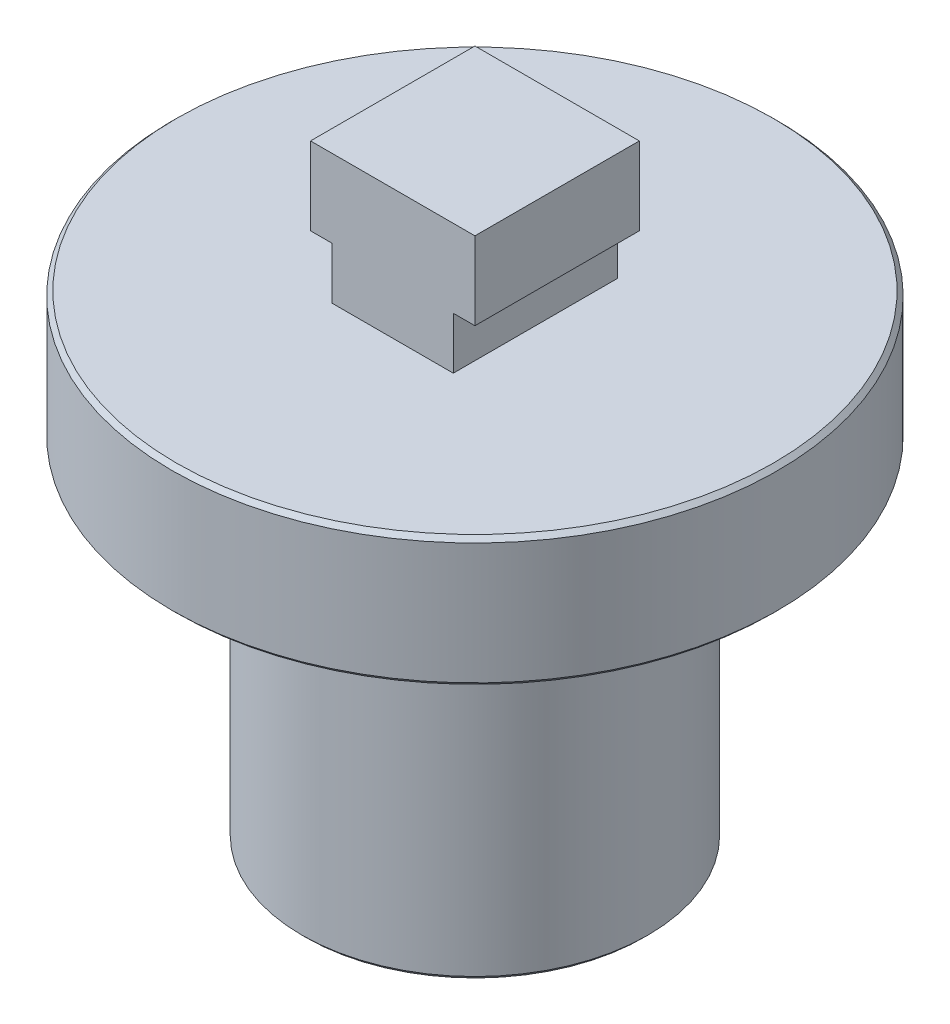
ISO-10303-21;
HEADER;
FILE_DESCRIPTION(('STEP AP214'),'2;1');
FILE_NAME('part.step','',(''),(''),'','','');
FILE_SCHEMA(('AUTOMOTIVE_DESIGN { 1 0 10303 214 1 1 1 1 }'));
ENDSEC;
DATA;
#1=APPLICATION_CONTEXT('core data for automotive mechanical design processes');
#2=APPLICATION_PROTOCOL_DEFINITION('international standard','automotive_design',2000,#1);
#3=PRODUCT_CONTEXT('',#1,'mechanical');
#4=PRODUCT('Part','Part','',(#3));
#5=PRODUCT_RELATED_PRODUCT_CATEGORY('part','',(#4));
#6=PRODUCT_DEFINITION_FORMATION('','',#4);
#7=PRODUCT_DEFINITION_CONTEXT('part definition',#1,'design');
#8=PRODUCT_DEFINITION('design','',#6,#7);
#9=PRODUCT_DEFINITION_SHAPE('','',#8);
#10=(LENGTH_UNIT() NAMED_UNIT(*) SI_UNIT(.MILLI.,.METRE.));
#11=(NAMED_UNIT(*) PLANE_ANGLE_UNIT() SI_UNIT($,.RADIAN.));
#12=(NAMED_UNIT(*) SI_UNIT($,.STERADIAN.) SOLID_ANGLE_UNIT());
#13=UNCERTAINTY_MEASURE_WITH_UNIT(LENGTH_MEASURE(1.E-05),#10,'distance_accuracy_value','');
#14=(GEOMETRIC_REPRESENTATION_CONTEXT(3) GLOBAL_UNCERTAINTY_ASSIGNED_CONTEXT((#13)) GLOBAL_UNIT_ASSIGNED_CONTEXT((#10,
#11,#12)) REPRESENTATION_CONTEXT('',''));
#15=CARTESIAN_POINT('',(0.,0.,0.));
#16=DIRECTION('',(0.,0.,1.));
#17=DIRECTION('',(1.,0.,0.));
#18=AXIS2_PLACEMENT_3D('',#15,#16,#17);
#19=CARTESIAN_POINT('',(0.,11.,0.));
#20=DIRECTION('',(0.,-1.,0.));
#21=DIRECTION('',(0.,0.,-1.));
#22=AXIS2_PLACEMENT_3D('',#19,#20,#21);
#23=CYLINDRICAL_SURFACE('',#22,4.);
#24=CARTESIAN_POINT('',(0.,0.100000000000003,0.));
#25=DIRECTION('',(0.,1.,0.));
#26=DIRECTION('',(0.,0.,1.));
#27=AXIS2_PLACEMENT_3D('',#24,#25,#26);
#28=CIRCLE('',#27,4.);
#29=CARTESIAN_POINT('',(0.,0.100000000000003,4.));
#30=VERTEX_POINT('',#29);
#31=EDGE_CURVE('E226',#30,#30,#28,.T.);
#32=ORIENTED_EDGE('',*,*,#31,.T.);
#33=EDGE_LOOP('',(#32));
#34=FACE_BOUND('',#33,.T.);
#35=CARTESIAN_POINT('',(0.,8.,0.));
#36=DIRECTION('',(0.,1.,0.));
#37=DIRECTION('',(0.,0.,1.));
#38=AXIS2_PLACEMENT_3D('',#35,#36,#37);
#39=CIRCLE('',#38,4.);
#40=CARTESIAN_POINT('',(0.,8.,4.));
#41=VERTEX_POINT('',#40);
#42=EDGE_CURVE('E218',#41,#41,#39,.T.);
#43=ORIENTED_EDGE('',*,*,#42,.F.);
#44=EDGE_LOOP('',(#43));
#45=FACE_BOUND('',#44,.T.);
#46=ADVANCED_FACE('F35',(#34,#45),#23,.T.);
#47=CARTESIAN_POINT('',(0.,0.,0.));
#48=DIRECTION('',(0.,1.,0.));
#49=DIRECTION('',(0.,0.,1.));
#50=AXIS2_PLACEMENT_3D('',#47,#48,#49);
#51=PLANE('',#50);
#52=CARTESIAN_POINT('',(0.,0.,0.));
#53=DIRECTION('',(0.,1.,0.));
#54=DIRECTION('',(0.,0.,1.));
#55=AXIS2_PLACEMENT_3D('',#52,#53,#54);
#56=CIRCLE('',#55,3.9);
#57=CARTESIAN_POINT('',(0.,0.,3.9));
#58=VERTEX_POINT('',#57);
#59=EDGE_CURVE('E229',#58,#58,#56,.F.);
#60=ORIENTED_EDGE('',*,*,#59,.T.);
#61=EDGE_LOOP('',(#60));
#62=FACE_BOUND('',#61,.T.);
#63=DIRECTION('',(-1.,0.,0.));
#64=VECTOR('',#63,1.);
#65=CARTESIAN_POINT('',(-1.9,0.,1.9));
#66=LINE('',#65,#64);
#67=CARTESIAN_POINT('',(1.9,0.,1.9));
#68=VERTEX_POINT('',#67);
#69=CARTESIAN_POINT('',(-1.9,0.,1.9));
#70=VERTEX_POINT('',#69);
#71=EDGE_CURVE('E208',#68,#70,#66,.T.);
#72=ORIENTED_EDGE('',*,*,#71,.F.);
#73=DIRECTION('',(0.,0.,1.));
#74=VECTOR('',#73,1.);
#75=CARTESIAN_POINT('',(1.9,0.,-1.9));
#76=LINE('',#75,#74);
#77=CARTESIAN_POINT('',(1.9,0.,-1.9));
#78=VERTEX_POINT('',#77);
#79=EDGE_CURVE('E58',#78,#68,#76,.T.);
#80=ORIENTED_EDGE('',*,*,#79,.F.);
#81=DIRECTION('',(1.,0.,0.));
#82=VECTOR('',#81,1.);
#83=CARTESIAN_POINT('',(-1.9,0.,-1.9));
#84=LINE('',#83,#82);
#85=CARTESIAN_POINT('',(-1.9,0.,-1.9));
#86=VERTEX_POINT('',#85);
#87=EDGE_CURVE('E197',#86,#78,#84,.T.);
#88=ORIENTED_EDGE('',*,*,#87,.F.);
#89=DIRECTION('',(0.,0.,-1.));
#90=VECTOR('',#89,1.);
#91=CARTESIAN_POINT('',(-1.9,0.,-1.9));
#92=LINE('',#91,#90);
#93=EDGE_CURVE('E211',#70,#86,#92,.T.);
#94=ORIENTED_EDGE('',*,*,#93,.F.);
#95=EDGE_LOOP('',(#72,#80,#88,#94));
#96=FACE_BOUND('',#95,.T.);
#97=ADVANCED_FACE('F296',(#62,#96),#51,.F.);
#98=CARTESIAN_POINT('',(1.9,4.,-1.9));
#99=DIRECTION('',(1.,0.,0.));
#100=DIRECTION('',(0.,0.,-1.));
#101=AXIS2_PLACEMENT_3D('',#98,#99,#100);
#102=PLANE('',#101);
#103=ORIENTED_EDGE('',*,*,#79,.T.);
#104=DIRECTION('',(0.,-1.,0.));
#105=VECTOR('',#104,1.);
#106=CARTESIAN_POINT('',(1.9,4.,1.9));
#107=LINE('',#106,#105);
#108=CARTESIAN_POINT('',(1.9,4.,1.9));
#109=VERTEX_POINT('',#108);
#110=EDGE_CURVE('E206',#109,#68,#107,.T.);
#111=ORIENTED_EDGE('',*,*,#110,.F.);
#112=DIRECTION('',(0.,0.,1.));
#113=VECTOR('',#112,1.);
#114=CARTESIAN_POINT('',(1.9,4.,-1.9));
#115=LINE('',#114,#113);
#116=CARTESIAN_POINT('',(1.9,4.,-1.9));
#117=VERTEX_POINT('',#116);
#118=EDGE_CURVE('E193',#117,#109,#115,.T.);
#119=ORIENTED_EDGE('',*,*,#118,.F.);
#120=DIRECTION('',(0.,-1.,0.));
#121=VECTOR('',#120,1.);
#122=CARTESIAN_POINT('',(1.9,4.,-1.9));
#123=LINE('',#122,#121);
#124=EDGE_CURVE('E216',#117,#78,#123,.T.);
#125=ORIENTED_EDGE('',*,*,#124,.T.);
#126=EDGE_LOOP('',(#103,#111,#119,#125));
#127=FACE_BOUND('',#126,.T.);
#128=ADVANCED_FACE('F303',(#127),#102,.F.);
#129=CARTESIAN_POINT('',(-1.9,4.,-1.9));
#130=DIRECTION('',(0.,0.,-1.));
#131=DIRECTION('',(-1.,0.,0.));
#132=AXIS2_PLACEMENT_3D('',#129,#130,#131);
#133=PLANE('',#132);
#134=ORIENTED_EDGE('',*,*,#87,.T.);
#135=ORIENTED_EDGE('',*,*,#124,.F.);
#136=DIRECTION('',(1.,0.,0.));
#137=VECTOR('',#136,1.);
#138=CARTESIAN_POINT('',(-1.9,4.,-1.9));
#139=LINE('',#138,#137);
#140=CARTESIAN_POINT('',(-1.9,4.,-1.9));
#141=VERTEX_POINT('',#140);
#142=EDGE_CURVE('E203',#141,#117,#139,.T.);
#143=ORIENTED_EDGE('',*,*,#142,.F.);
#144=DIRECTION('',(0.,-1.,0.));
#145=VECTOR('',#144,1.);
#146=CARTESIAN_POINT('',(-1.9,4.,-1.9));
#147=LINE('',#146,#145);
#148=EDGE_CURVE('E219',#141,#86,#147,.T.);
#149=ORIENTED_EDGE('',*,*,#148,.T.);
#150=EDGE_LOOP('',(#134,#135,#143,#149));
#151=FACE_BOUND('',#150,.T.);
#152=ADVANCED_FACE('F329',(#151),#133,.F.);
#153=CARTESIAN_POINT('',(-1.9,4.,-1.9));
#154=DIRECTION('',(-1.,0.,0.));
#155=DIRECTION('',(0.,0.,1.));
#156=AXIS2_PLACEMENT_3D('',#153,#154,#155);
#157=PLANE('',#156);
#158=ORIENTED_EDGE('',*,*,#93,.T.);
#159=ORIENTED_EDGE('',*,*,#148,.F.);
#160=DIRECTION('',(0.,0.,-1.));
#161=VECTOR('',#160,1.);
#162=CARTESIAN_POINT('',(-1.9,4.,-1.9));
#163=LINE('',#162,#161);
#164=CARTESIAN_POINT('',(-1.9,4.,1.9));
#165=VERTEX_POINT('',#164);
#166=EDGE_CURVE('E200',#165,#141,#163,.T.);
#167=ORIENTED_EDGE('',*,*,#166,.F.);
#168=DIRECTION('',(0.,-1.,0.));
#169=VECTOR('',#168,1.);
#170=CARTESIAN_POINT('',(-1.9,4.,1.9));
#171=LINE('',#170,#169);
#172=EDGE_CURVE('E221',#165,#70,#171,.T.);
#173=ORIENTED_EDGE('',*,*,#172,.T.);
#174=EDGE_LOOP('',(#158,#159,#167,#173));
#175=FACE_BOUND('',#174,.T.);
#176=ADVANCED_FACE('F331',(#175),#157,.F.);
#177=CARTESIAN_POINT('',(-1.9,4.,1.9));
#178=DIRECTION('',(0.,0.,1.));
#179=DIRECTION('',(1.,0.,0.));
#180=AXIS2_PLACEMENT_3D('',#177,#178,#179);
#181=PLANE('',#180);
#182=ORIENTED_EDGE('',*,*,#71,.T.);
#183=ORIENTED_EDGE('',*,*,#172,.F.);
#184=DIRECTION('',(-1.,0.,0.));
#185=VECTOR('',#184,1.);
#186=CARTESIAN_POINT('',(-1.9,4.,1.9));
#187=LINE('',#186,#185);
#188=EDGE_CURVE('E196',#109,#165,#187,.T.);
#189=ORIENTED_EDGE('',*,*,#188,.F.);
#190=ORIENTED_EDGE('',*,*,#110,.T.);
#191=EDGE_LOOP('',(#182,#183,#189,#190));
#192=FACE_BOUND('',#191,.T.);
#193=ADVANCED_FACE('F321',(#192),#181,.F.);
#194=CARTESIAN_POINT('',(0.,4.,0.));
#195=DIRECTION('',(0.,1.,0.));
#196=DIRECTION('',(0.,0.,1.));
#197=AXIS2_PLACEMENT_3D('',#194,#195,#196);
#198=PLANE('',#197);
#199=ORIENTED_EDGE('',*,*,#118,.T.);
#200=ORIENTED_EDGE('',*,*,#188,.T.);
#201=ORIENTED_EDGE('',*,*,#166,.T.);
#202=ORIENTED_EDGE('',*,*,#142,.T.);
#203=EDGE_LOOP('',(#199,#200,#201,#202));
#204=FACE_BOUND('',#203,.T.);
#205=ADVANCED_FACE('F327',(#204),#198,.F.);
#206=CARTESIAN_POINT('',(0.,8.,0.));
#207=DIRECTION('',(0.,1.,0.));
#208=DIRECTION('',(0.,0.,1.));
#209=AXIS2_PLACEMENT_3D('',#206,#207,#208);
#210=PLANE('',#209);
#211=CARTESIAN_POINT('',(0.,8.,0.));
#212=DIRECTION('',(0.,1.,0.));
#213=DIRECTION('',(0.,0.,1.));
#214=AXIS2_PLACEMENT_3D('',#211,#212,#213);
#215=CIRCLE('',#214,6.9);
#216=CARTESIAN_POINT('',(0.,8.,6.9));
#217=VERTEX_POINT('',#216);
#218=EDGE_CURVE('E43',#217,#217,#215,.F.);
#219=ORIENTED_EDGE('',*,*,#218,.T.);
#220=EDGE_LOOP('',(#219));
#221=FACE_BOUND('',#220,.T.);
#222=ORIENTED_EDGE('',*,*,#42,.T.);
#223=EDGE_LOOP('',(#222));
#224=FACE_BOUND('',#223,.T.);
#225=ADVANCED_FACE('F240',(#221,#224),#210,.F.);
#226=CARTESIAN_POINT('',(0.,8.,0.));
#227=DIRECTION('',(0.,1.,0.));
#228=DIRECTION('',(0.,0.,1.));
#229=AXIS2_PLACEMENT_3D('',#226,#227,#228);
#230=CYLINDRICAL_SURFACE('',#229,7.);
#231=CARTESIAN_POINT('',(0.,8.1,0.));
#232=DIRECTION('',(0.,1.,0.));
#233=DIRECTION('',(0.,0.,1.));
#234=AXIS2_PLACEMENT_3D('',#231,#232,#233);
#235=CIRCLE('',#234,7.);
#236=CARTESIAN_POINT('',(0.,8.1,7.));
#237=VERTEX_POINT('',#236);
#238=EDGE_CURVE('E235',#237,#237,#235,.T.);
#239=ORIENTED_EDGE('',*,*,#238,.T.);
#240=EDGE_LOOP('',(#239));
#241=FACE_BOUND('',#240,.T.);
#242=CARTESIAN_POINT('',(0.,10.9,0.));
#243=DIRECTION('',(0.,1.,0.));
#244=DIRECTION('',(0.,0.,1.));
#245=AXIS2_PLACEMENT_3D('',#242,#243,#244);
#246=CIRCLE('',#245,7.);
#247=CARTESIAN_POINT('',(0.,10.9,7.));
#248=VERTEX_POINT('',#247);
#249=EDGE_CURVE('E232',#248,#248,#246,.F.);
#250=ORIENTED_EDGE('',*,*,#249,.T.);
#251=EDGE_LOOP('',(#250));
#252=FACE_BOUND('',#251,.T.);
#253=ADVANCED_FACE('F249',(#241,#252),#230,.T.);
#254=CARTESIAN_POINT('',(1.9,14.,1.9));
#255=DIRECTION('',(-1.,0.,0.));
#256=DIRECTION('',(0.,0.,1.));
#257=AXIS2_PLACEMENT_3D('',#254,#255,#256);
#258=PLANE('',#257);
#259=DIRECTION('',(0.,-1.,0.));
#260=VECTOR('',#259,1.);
#261=CARTESIAN_POINT('',(1.9,14.,1.9));
#262=LINE('',#261,#260);
#263=CARTESIAN_POINT('',(1.9,14.,1.9));
#264=VERTEX_POINT('',#263);
#265=CARTESIAN_POINT('',(1.9,12.2,1.9));
#266=VERTEX_POINT('',#265);
#267=EDGE_CURVE('E180',#264,#266,#262,.T.);
#268=ORIENTED_EDGE('',*,*,#267,.T.);
#269=DIRECTION('',(0.,0.,1.));
#270=VECTOR('',#269,1.);
#271=CARTESIAN_POINT('',(1.9,12.2,-11.1));
#272=LINE('',#271,#270);
#273=CARTESIAN_POINT('',(1.9,12.2,-1.9));
#274=VERTEX_POINT('',#273);
#275=EDGE_CURVE('E50',#274,#266,#272,.T.);
#276=ORIENTED_EDGE('',*,*,#275,.F.);
#277=DIRECTION('',(0.,-1.,0.));
#278=VECTOR('',#277,1.);
#279=CARTESIAN_POINT('',(1.9,14.,-1.9));
#280=LINE('',#279,#278);
#281=CARTESIAN_POINT('',(1.9,14.,-1.9));
#282=VERTEX_POINT('',#281);
#283=EDGE_CURVE('E190',#282,#274,#280,.T.);
#284=ORIENTED_EDGE('',*,*,#283,.F.);
#285=DIRECTION('',(0.,0.,-1.));
#286=VECTOR('',#285,1.);
#287=CARTESIAN_POINT('',(1.9,14.,1.9));
#288=LINE('',#287,#286);
#289=EDGE_CURVE('E171',#264,#282,#288,.T.);
#290=ORIENTED_EDGE('',*,*,#289,.F.);
#291=EDGE_LOOP('',(#268,#276,#284,#290));
#292=FACE_BOUND('',#291,.T.);
#293=ADVANCED_FACE('F252',(#292),#258,.F.);
#294=CARTESIAN_POINT('',(0.,14.,0.));
#295=DIRECTION('',(0.,-1.,0.));
#296=DIRECTION('',(0.,0.,-1.));
#297=AXIS2_PLACEMENT_3D('',#294,#295,#296);
#298=PLANE('',#297);
#299=ORIENTED_EDGE('',*,*,#289,.T.);
#300=DIRECTION('',(-1.,0.,0.));
#301=VECTOR('',#300,1.);
#302=CARTESIAN_POINT('',(-1.9,14.,-1.9));
#303=LINE('',#302,#301);
#304=CARTESIAN_POINT('',(-1.9,14.,-1.9));
#305=VERTEX_POINT('',#304);
#306=EDGE_CURVE('E174',#282,#305,#303,.T.);
#307=ORIENTED_EDGE('',*,*,#306,.T.);
#308=DIRECTION('',(0.,0.,1.));
#309=VECTOR('',#308,1.);
#310=CARTESIAN_POINT('',(-1.9,14.,1.9));
#311=LINE('',#310,#309);
#312=CARTESIAN_POINT('',(-1.9,14.,1.9));
#313=VERTEX_POINT('',#312);
#314=EDGE_CURVE('E176',#305,#313,#311,.T.);
#315=ORIENTED_EDGE('',*,*,#314,.T.);
#316=DIRECTION('',(1.,0.,0.));
#317=VECTOR('',#316,1.);
#318=CARTESIAN_POINT('',(-1.9,14.,1.9));
#319=LINE('',#318,#317);
#320=EDGE_CURVE('E178',#313,#264,#319,.T.);
#321=ORIENTED_EDGE('',*,*,#320,.T.);
#322=EDGE_LOOP('',(#299,#307,#315,#321));
#323=FACE_BOUND('',#322,.T.);
#324=ADVANCED_FACE('F282',(#323),#298,.F.);
#325=CARTESIAN_POINT('',(-1.9,14.,1.9));
#326=DIRECTION('',(1.,0.,0.));
#327=DIRECTION('',(0.,0.,-1.));
#328=AXIS2_PLACEMENT_3D('',#325,#326,#327);
#329=PLANE('',#328);
#330=DIRECTION('',(0.,-1.,0.));
#331=VECTOR('',#330,1.);
#332=CARTESIAN_POINT('',(-1.9,14.,-1.9));
#333=LINE('',#332,#331);
#334=CARTESIAN_POINT('',(-1.9,12.2,-1.9));
#335=VERTEX_POINT('',#334);
#336=EDGE_CURVE('E187',#305,#335,#333,.T.);
#337=ORIENTED_EDGE('',*,*,#336,.T.);
#338=DIRECTION('',(0.,0.,1.));
#339=VECTOR('',#338,1.);
#340=CARTESIAN_POINT('',(-1.9,12.2,-11.1));
#341=LINE('',#340,#339);
#342=CARTESIAN_POINT('',(-1.9,12.2,1.9));
#343=VERTEX_POINT('',#342);
#344=EDGE_CURVE('E158',#335,#343,#341,.T.);
#345=ORIENTED_EDGE('',*,*,#344,.T.);
#346=DIRECTION('',(0.,-1.,0.));
#347=VECTOR('',#346,1.);
#348=CARTESIAN_POINT('',(-1.9,14.,1.9));
#349=LINE('',#348,#347);
#350=EDGE_CURVE('E184',#313,#343,#349,.T.);
#351=ORIENTED_EDGE('',*,*,#350,.F.);
#352=ORIENTED_EDGE('',*,*,#314,.F.);
#353=EDGE_LOOP('',(#337,#345,#351,#352));
#354=FACE_BOUND('',#353,.T.);
#355=ADVANCED_FACE('F278',(#354),#329,.F.);
#356=CARTESIAN_POINT('',(-1.9,12.2,-11.1));
#357=DIRECTION('',(0.,1.,0.));
#358=DIRECTION('',(0.,0.,1.));
#359=AXIS2_PLACEMENT_3D('',#356,#357,#358);
#360=PLANE('',#359);
#361=DIRECTION('',(0.,0.,1.));
#362=VECTOR('',#361,1.);
#363=CARTESIAN_POINT('',(-1.4,12.2,-11.1));
#364=LINE('',#363,#362);
#365=CARTESIAN_POINT('',(-1.4,12.2,-1.9));
#366=VERTEX_POINT('',#365);
#367=CARTESIAN_POINT('',(-1.4,12.2,1.9));
#368=VERTEX_POINT('',#367);
#369=EDGE_CURVE('E162',#366,#368,#364,.T.);
#370=ORIENTED_EDGE('',*,*,#369,.T.);
#371=DIRECTION('',(-1.,0.,0.));
#372=VECTOR('',#371,1.);
#373=CARTESIAN_POINT('',(-1.9,12.2,1.9));
#374=LINE('',#373,#372);
#375=EDGE_CURVE('E155',#368,#343,#374,.T.);
#376=ORIENTED_EDGE('',*,*,#375,.T.);
#377=ORIENTED_EDGE('',*,*,#344,.F.);
#378=DIRECTION('',(-1.,0.,0.));
#379=VECTOR('',#378,1.);
#380=CARTESIAN_POINT('',(-1.9,12.2,-1.9));
#381=LINE('',#380,#379);
#382=EDGE_CURVE('E167',#366,#335,#381,.T.);
#383=ORIENTED_EDGE('',*,*,#382,.F.);
#384=EDGE_LOOP('',(#370,#376,#377,#383));
#385=FACE_BOUND('',#384,.T.);
#386=ADVANCED_FACE('F274',(#385),#360,.F.);
#387=CARTESIAN_POINT('',(1.9,12.2,-11.1));
#388=DIRECTION('',(0.,1.,0.));
#389=DIRECTION('',(0.,0.,1.));
#390=AXIS2_PLACEMENT_3D('',#387,#388,#389);
#391=PLANE('',#390);
#392=ORIENTED_EDGE('',*,*,#275,.T.);
#393=DIRECTION('',(-1.,0.,0.));
#394=VECTOR('',#393,1.);
#395=CARTESIAN_POINT('',(1.9,12.2,1.9));
#396=LINE('',#395,#394);
#397=CARTESIAN_POINT('',(1.4,12.2,1.9));
#398=VERTEX_POINT('',#397);
#399=EDGE_CURVE('E135',#266,#398,#396,.T.);
#400=ORIENTED_EDGE('',*,*,#399,.T.);
#401=DIRECTION('',(0.,0.,1.));
#402=VECTOR('',#401,1.);
#403=CARTESIAN_POINT('',(1.4,12.2,-11.1));
#404=LINE('',#403,#402);
#405=CARTESIAN_POINT('',(1.4,12.2,-1.9));
#406=VERTEX_POINT('',#405);
#407=EDGE_CURVE('E125',#406,#398,#404,.T.);
#408=ORIENTED_EDGE('',*,*,#407,.F.);
#409=DIRECTION('',(-1.,0.,0.));
#410=VECTOR('',#409,1.);
#411=CARTESIAN_POINT('',(-1.9,12.2,-1.9));
#412=LINE('',#411,#410);
#413=EDGE_CURVE('E148',#274,#406,#412,.T.);
#414=ORIENTED_EDGE('',*,*,#413,.F.);
#415=EDGE_LOOP('',(#392,#400,#408,#414));
#416=FACE_BOUND('',#415,.T.);
#417=ADVANCED_FACE('F136',(#416),#391,.F.);
#418=CARTESIAN_POINT('',(-1.4,11.,-11.1));
#419=DIRECTION('',(1.,0.,0.));
#420=DIRECTION('',(0.,0.,-1.));
#421=AXIS2_PLACEMENT_3D('',#418,#419,#420);
#422=PLANE('',#421);
#423=DIRECTION('',(0.,0.,1.));
#424=VECTOR('',#423,1.);
#425=CARTESIAN_POINT('',(-1.4,11.,-11.1));
#426=LINE('',#425,#424);
#427=CARTESIAN_POINT('',(-1.4,11.,-1.9));
#428=VERTEX_POINT('',#427);
#429=CARTESIAN_POINT('',(-1.4,11.,1.9));
#430=VERTEX_POINT('',#429);
#431=EDGE_CURVE('E157',#428,#430,#426,.T.);
#432=ORIENTED_EDGE('',*,*,#431,.T.);
#433=DIRECTION('',(0.,1.,0.));
#434=VECTOR('',#433,1.);
#435=CARTESIAN_POINT('',(-1.4,11.,1.9));
#436=LINE('',#435,#434);
#437=EDGE_CURVE('E152',#430,#368,#436,.T.);
#438=ORIENTED_EDGE('',*,*,#437,.T.);
#439=ORIENTED_EDGE('',*,*,#369,.F.);
#440=DIRECTION('',(0.,1.,0.));
#441=VECTOR('',#440,1.);
#442=CARTESIAN_POINT('',(-1.4,14.,-1.9));
#443=LINE('',#442,#441);
#444=EDGE_CURVE('E161',#428,#366,#443,.T.);
#445=ORIENTED_EDGE('',*,*,#444,.F.);
#446=EDGE_LOOP('',(#432,#438,#439,#445));
#447=FACE_BOUND('',#446,.T.);
#448=ADVANCED_FACE('F271',(#447),#422,.F.);
#449=CARTESIAN_POINT('',(-1.9,14.,1.9));
#450=DIRECTION('',(0.,0.,-1.));
#451=DIRECTION('',(-1.,0.,0.));
#452=AXIS2_PLACEMENT_3D('',#449,#450,#451);
#453=PLANE('',#452);
#454=DIRECTION('',(1.,0.,0.));
#455=VECTOR('',#454,1.);
#456=CARTESIAN_POINT('',(-1.9,11.,1.9));
#457=LINE('',#456,#455);
#458=CARTESIAN_POINT('',(1.4,11.,1.9));
#459=VERTEX_POINT('',#458);
#460=EDGE_CURVE('E144',#430,#459,#457,.T.);
#461=ORIENTED_EDGE('',*,*,#460,.T.);
#462=DIRECTION('',(0.,-1.,0.));
#463=VECTOR('',#462,1.);
#464=CARTESIAN_POINT('',(1.4,11.,1.9));
#465=LINE('',#464,#463);
#466=EDGE_CURVE('E128',#398,#459,#465,.T.);
#467=ORIENTED_EDGE('',*,*,#466,.F.);
#468=ORIENTED_EDGE('',*,*,#399,.F.);
#469=ORIENTED_EDGE('',*,*,#267,.F.);
#470=ORIENTED_EDGE('',*,*,#320,.F.);
#471=ORIENTED_EDGE('',*,*,#350,.T.);
#472=ORIENTED_EDGE('',*,*,#375,.F.);
#473=ORIENTED_EDGE('',*,*,#437,.F.);
#474=EDGE_LOOP('',(#461,#467,#468,#469,#470,#471,#472,#473));
#475=FACE_BOUND('',#474,.T.);
#476=ADVANCED_FACE('F141',(#475),#453,.F.);
#477=CARTESIAN_POINT('',(1.4,11.,-11.1));
#478=DIRECTION('',(-1.,0.,0.));
#479=DIRECTION('',(0.,0.,1.));
#480=AXIS2_PLACEMENT_3D('',#477,#478,#479);
#481=PLANE('',#480);
#482=ORIENTED_EDGE('',*,*,#407,.T.);
#483=ORIENTED_EDGE('',*,*,#466,.T.);
#484=DIRECTION('',(0.,0.,1.));
#485=VECTOR('',#484,1.);
#486=CARTESIAN_POINT('',(1.4,11.,-11.1));
#487=LINE('',#486,#485);
#488=CARTESIAN_POINT('',(1.4,11.,-1.9));
#489=VERTEX_POINT('',#488);
#490=EDGE_CURVE('E133',#489,#459,#487,.T.);
#491=ORIENTED_EDGE('',*,*,#490,.F.);
#492=DIRECTION('',(0.,-1.,0.));
#493=VECTOR('',#492,1.);
#494=CARTESIAN_POINT('',(1.4,14.,-1.9));
#495=LINE('',#494,#493);
#496=EDGE_CURVE('E131',#406,#489,#495,.T.);
#497=ORIENTED_EDGE('',*,*,#496,.F.);
#498=EDGE_LOOP('',(#482,#483,#491,#497));
#499=FACE_BOUND('',#498,.T.);
#500=ADVANCED_FACE('F126',(#499),#481,.F.);
#501=CARTESIAN_POINT('',(-1.9,14.,-1.9));
#502=DIRECTION('',(0.,0.,1.));
#503=DIRECTION('',(1.,0.,0.));
#504=AXIS2_PLACEMENT_3D('',#501,#502,#503);
#505=PLANE('',#504);
#506=ORIENTED_EDGE('',*,*,#413,.T.);
#507=ORIENTED_EDGE('',*,*,#496,.T.);
#508=DIRECTION('',(-1.,0.,0.));
#509=VECTOR('',#508,1.);
#510=CARTESIAN_POINT('',(-1.9,11.,-1.9));
#511=LINE('',#510,#509);
#512=EDGE_CURVE('E170',#489,#428,#511,.T.);
#513=ORIENTED_EDGE('',*,*,#512,.T.);
#514=ORIENTED_EDGE('',*,*,#444,.T.);
#515=ORIENTED_EDGE('',*,*,#382,.T.);
#516=ORIENTED_EDGE('',*,*,#336,.F.);
#517=ORIENTED_EDGE('',*,*,#306,.F.);
#518=ORIENTED_EDGE('',*,*,#283,.T.);
#519=EDGE_LOOP('',(#506,#507,#513,#514,#515,#516,#517,#518));
#520=FACE_BOUND('',#519,.T.);
#521=ADVANCED_FACE('F263',(#520),#505,.F.);
#522=CARTESIAN_POINT('',(0.,11.,0.));
#523=DIRECTION('',(0.,1.,0.));
#524=DIRECTION('',(0.,0.,1.));
#525=AXIS2_PLACEMENT_3D('',#522,#523,#524);
#526=PLANE('',#525);
#527=CARTESIAN_POINT('',(0.,11.,0.));
#528=DIRECTION('',(0.,1.,0.));
#529=DIRECTION('',(0.,0.,1.));
#530=AXIS2_PLACEMENT_3D('',#527,#528,#529);
#531=CIRCLE('',#530,6.90000000000001);
#532=CARTESIAN_POINT('',(0.,11.,6.90000000000001));
#533=VERTEX_POINT('',#532);
#534=EDGE_CURVE('E11',#533,#533,#531,.T.);
#535=ORIENTED_EDGE('',*,*,#534,.T.);
#536=EDGE_LOOP('',(#535));
#537=FACE_BOUND('',#536,.T.);
#538=ORIENTED_EDGE('',*,*,#512,.F.);
#539=ORIENTED_EDGE('',*,*,#490,.T.);
#540=ORIENTED_EDGE('',*,*,#460,.F.);
#541=ORIENTED_EDGE('',*,*,#431,.F.);
#542=EDGE_LOOP('',(#538,#539,#540,#541));
#543=FACE_BOUND('',#542,.T.);
#544=ADVANCED_FACE('F260',(#537,#543),#526,.T.);
#545=CARTESIAN_POINT('',(0.,0.100000000000003,0.));
#546=DIRECTION('',(0.,1.,0.));
#547=DIRECTION('',(0.,0.,1.));
#548=AXIS2_PLACEMENT_3D('',#545,#546,#547);
#549=CONICAL_SURFACE('',#548,4.,0.785398163397444);
#550=ORIENTED_EDGE('',*,*,#59,.F.);
#551=EDGE_LOOP('',(#550));
#552=FACE_BOUND('',#551,.T.);
#553=ORIENTED_EDGE('',*,*,#31,.F.);
#554=EDGE_LOOP('',(#553));
#555=FACE_BOUND('',#554,.T.);
#556=ADVANCED_FACE('F246',(#552,#555),#549,.T.);
#557=CARTESIAN_POINT('',(0.,8.1,0.));
#558=DIRECTION('',(0.,1.,0.));
#559=DIRECTION('',(0.,0.,1.));
#560=AXIS2_PLACEMENT_3D('',#557,#558,#559);
#561=CONICAL_SURFACE('',#560,7.,0.785398163397444);
#562=ORIENTED_EDGE('',*,*,#218,.F.);
#563=EDGE_LOOP('',(#562));
#564=FACE_BOUND('',#563,.T.);
#565=ORIENTED_EDGE('',*,*,#238,.F.);
#566=EDGE_LOOP('',(#565));
#567=FACE_BOUND('',#566,.T.);
#568=ADVANCED_FACE('F243',(#564,#567),#561,.T.);
#569=CARTESIAN_POINT('',(0.,11.,0.));
#570=DIRECTION('',(0.,-1.,0.));
#571=DIRECTION('',(0.,0.,-1.));
#572=AXIS2_PLACEMENT_3D('',#569,#570,#571);
#573=CONICAL_SURFACE('',#572,6.90000000000001,0.785398163397453);
#574=ORIENTED_EDGE('',*,*,#249,.F.);
#575=EDGE_LOOP('',(#574));
#576=FACE_BOUND('',#575,.T.);
#577=ORIENTED_EDGE('',*,*,#534,.F.);
#578=EDGE_LOOP('',(#577));
#579=FACE_BOUND('',#578,.T.);
#580=ADVANCED_FACE('F37',(#576,#579),#573,.T.);
#581=CLOSED_SHELL('',(#46,#97,#128,#152,#176,#193,#205,#225,#253,#293,#324,#355,#386,#417,#448,
#476,#500,#521,#544,#556,#568,#580));
#582=MANIFOLD_SOLID_BREP('B2',#581);
#583=ADVANCED_BREP_SHAPE_REPRESENTATION('',(#18,#582),#14);
#584=SHAPE_DEFINITION_REPRESENTATION(#9,#583);
ENDSEC;
END-ISO-10303-21;
